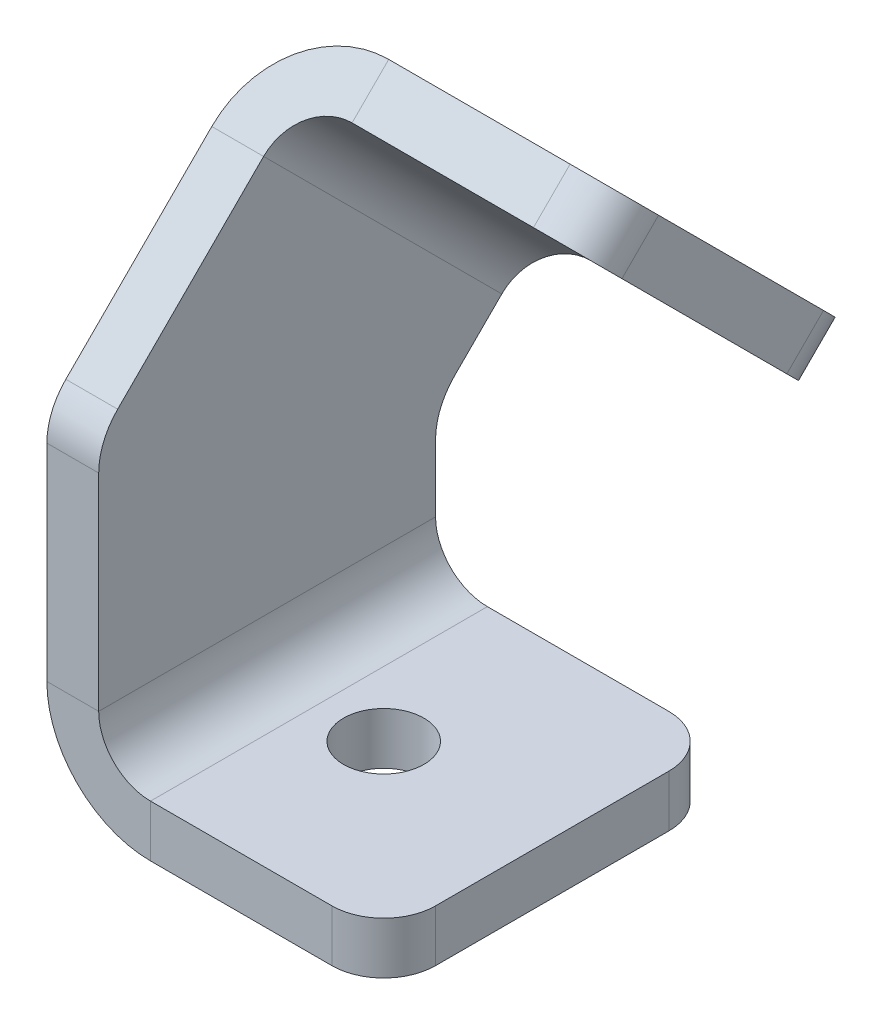
ISO-10303-21;
HEADER;
FILE_DESCRIPTION(('STEP AP214'),'2;1');
FILE_NAME('part.step','',(''),(''),'','','');
FILE_SCHEMA(('AUTOMOTIVE_DESIGN { 1 0 10303 214 1 1 1 1 }'));
ENDSEC;
DATA;
#1=APPLICATION_CONTEXT('core data for automotive mechanical design processes');
#2=APPLICATION_PROTOCOL_DEFINITION('international standard','automotive_design',2000,#1);
#3=PRODUCT_CONTEXT('',#1,'mechanical');
#4=PRODUCT('Part','Part','',(#3));
#5=PRODUCT_RELATED_PRODUCT_CATEGORY('part','',(#4));
#6=PRODUCT_DEFINITION_FORMATION('','',#4);
#7=PRODUCT_DEFINITION_CONTEXT('part definition',#1,'design');
#8=PRODUCT_DEFINITION('design','',#6,#7);
#9=PRODUCT_DEFINITION_SHAPE('','',#8);
#10=(LENGTH_UNIT() NAMED_UNIT(*) SI_UNIT(.MILLI.,.METRE.));
#11=(NAMED_UNIT(*) PLANE_ANGLE_UNIT() SI_UNIT($,.RADIAN.));
#12=(NAMED_UNIT(*) SI_UNIT($,.STERADIAN.) SOLID_ANGLE_UNIT());
#13=UNCERTAINTY_MEASURE_WITH_UNIT(LENGTH_MEASURE(1.E-05),#10,'distance_accuracy_value','');
#14=(GEOMETRIC_REPRESENTATION_CONTEXT(3) GLOBAL_UNCERTAINTY_ASSIGNED_CONTEXT((#13)) GLOBAL_UNIT_ASSIGNED_CONTEXT((#10,
#11,#12)) REPRESENTATION_CONTEXT('',''));
#15=CARTESIAN_POINT('',(0.,0.,0.));
#16=DIRECTION('',(0.,0.,1.));
#17=DIRECTION('',(1.,0.,0.));
#18=AXIS2_PLACEMENT_3D('',#15,#16,#17);
#19=CARTESIAN_POINT('',(-9.79412775812671,3.31915890761504,12.5965463921812));
#20=DIRECTION('',(1.,0.,0.));
#21=DIRECTION('',(0.,0.,-1.));
#22=AXIS2_PLACEMENT_3D('',#19,#20,#21);
#23=CYLINDRICAL_SURFACE('',#22,5.);
#24=DIRECTION('',(1.,0.,0.));
#25=VECTOR('',#24,1.);
#26=CARTESIAN_POINT('',(-9.79412775812671,6.85469281354778,16.132080298114));
#27=LINE('',#26,#25);
#28=CARTESIAN_POINT('',(-13.7941277581267,6.85469281354778,16.132080298114));
#29=VERTEX_POINT('',#28);
#30=CARTESIAN_POINT('',(-9.79412775812671,6.85469281354778,16.132080298114));
#31=VERTEX_POINT('',#30);
#32=EDGE_CURVE('E10',#29,#31,#27,.T.);
#33=ORIENTED_EDGE('',*,*,#32,.F.);
#34=CARTESIAN_POINT('',(-13.7941277581267,3.31915890761504,12.5965463921812));
#35=DIRECTION('',(1.,0.,0.));
#36=DIRECTION('',(0.,0.,-1.));
#37=AXIS2_PLACEMENT_3D('',#34,#35,#36);
#38=CIRCLE('',#37,5.);
#39=CARTESIAN_POINT('',(-13.7941277581267,3.31915890761504,17.5965463921812));
#40=VERTEX_POINT('',#39);
#41=EDGE_CURVE('E136',#29,#40,#38,.T.);
#42=ORIENTED_EDGE('',*,*,#41,.T.);
#43=DIRECTION('',(1.,0.,0.));
#44=VECTOR('',#43,1.);
#45=CARTESIAN_POINT('',(-9.79412775812671,3.31915890761504,17.5965463921812));
#46=LINE('',#45,#44);
#47=CARTESIAN_POINT('',(-9.79412775812671,3.31915890761504,17.5965463921812));
#48=VERTEX_POINT('',#47);
#49=EDGE_CURVE('E26',#40,#48,#46,.T.);
#50=ORIENTED_EDGE('',*,*,#49,.T.);
#51=CARTESIAN_POINT('',(-9.79412775812671,3.31915890761504,12.5965463921812));
#52=DIRECTION('',(1.,0.,0.));
#53=DIRECTION('',(0.,0.,-1.));
#54=AXIS2_PLACEMENT_3D('',#51,#52,#53);
#55=CIRCLE('',#54,5.);
#56=EDGE_CURVE('E254',#31,#48,#55,.T.);
#57=ORIENTED_EDGE('',*,*,#56,.F.);
#58=EDGE_LOOP('',(#33,#42,#50,#57));
#59=FACE_BOUND('',#58,.T.);
#60=ADVANCED_FACE('F16',(#59),#23,.T.);
#61=CARTESIAN_POINT('',(-9.79412775812671,-20.6097732805195,17.5965463921812));
#62=DIRECTION('',(0.,0.,-1.));
#63=DIRECTION('',(0.,1.,0.));
#64=AXIS2_PLACEMENT_3D('',#61,#62,#63);
#65=PLANE('',#64);
#66=ORIENTED_EDGE('',*,*,#49,.F.);
#67=DIRECTION('',(0.,1.,0.));
#68=VECTOR('',#67,1.);
#69=CARTESIAN_POINT('',(-13.7941277581267,-20.6097732805195,17.5965463921812));
#70=LINE('',#69,#68);
#71=CARTESIAN_POINT('',(-13.7941277581267,-12.6097732805195,17.5965463921812));
#72=VERTEX_POINT('',#71);
#73=EDGE_CURVE('E195',#40,#72,#70,.F.);
#74=ORIENTED_EDGE('',*,*,#73,.T.);
#75=DIRECTION('',(1.,0.,0.));
#76=VECTOR('',#75,1.);
#77=CARTESIAN_POINT('',(-9.79412775812671,-12.6097732805195,17.5965463921812));
#78=LINE('',#77,#76);
#79=CARTESIAN_POINT('',(-9.79412775812671,-12.6097732805195,17.5965463921812));
#80=VERTEX_POINT('',#79);
#81=EDGE_CURVE('E247',#72,#80,#78,.T.);
#82=ORIENTED_EDGE('',*,*,#81,.T.);
#83=DIRECTION('',(0.,1.,0.));
#84=VECTOR('',#83,1.);
#85=CARTESIAN_POINT('',(-9.79412775812671,-20.6097732805195,17.5965463921812));
#86=LINE('',#85,#84);
#87=EDGE_CURVE('E264',#48,#80,#86,.F.);
#88=ORIENTED_EDGE('',*,*,#87,.F.);
#89=EDGE_LOOP('',(#66,#74,#82,#88));
#90=FACE_BOUND('',#89,.T.);
#91=ADVANCED_FACE('F267',(#90),#65,.F.);
#92=CARTESIAN_POINT('',(-5.7941277581267,-12.6097732805195,17.5965463921812));
#93=DIRECTION('',(0.,0.,1.));
#94=DIRECTION('',(1.,0.,0.));
#95=AXIS2_PLACEMENT_3D('',#92,#93,#94);
#96=PLANE('',#95);
#97=ORIENTED_EDGE('',*,*,#81,.F.);
#98=CARTESIAN_POINT('',(-5.7941277581267,-12.6097732805195,17.5965463921812));
#99=DIRECTION('',(0.,0.,1.));
#100=DIRECTION('',(1.,0.,0.));
#101=AXIS2_PLACEMENT_3D('',#98,#99,#100);
#102=CIRCLE('',#101,8.);
#103=CARTESIAN_POINT('',(-5.79412775812671,-20.6097732805195,17.5965463921812));
#104=VERTEX_POINT('',#103);
#105=EDGE_CURVE('E170',#104,#72,#102,.F.);
#106=ORIENTED_EDGE('',*,*,#105,.F.);
#107=DIRECTION('',(0.,1.,0.));
#108=VECTOR('',#107,1.);
#109=CARTESIAN_POINT('',(-5.7941277581267,-16.6097732805195,17.5965463921812));
#110=LINE('',#109,#108);
#111=CARTESIAN_POINT('',(-5.7941277581267,-16.6097732805195,17.5965463921812));
#112=VERTEX_POINT('',#111);
#113=EDGE_CURVE('E244',#104,#112,#110,.T.);
#114=ORIENTED_EDGE('',*,*,#113,.T.);
#115=CARTESIAN_POINT('',(-5.7941277581267,-12.6097732805195,17.5965463921812));
#116=DIRECTION('',(0.,0.,-1.));
#117=DIRECTION('',(-1.,0.,0.));
#118=AXIS2_PLACEMENT_3D('',#115,#116,#117);
#119=CIRCLE('',#118,4.);
#120=EDGE_CURVE('E279',#112,#80,#119,.T.);
#121=ORIENTED_EDGE('',*,*,#120,.T.);
#122=EDGE_LOOP('',(#97,#106,#114,#121));
#123=FACE_BOUND('',#122,.T.);
#124=ADVANCED_FACE('F336',(#123),#96,.T.);
#125=CARTESIAN_POINT('',(-13.7941277581267,-16.6097732805195,17.5965463921812));
#126=DIRECTION('',(0.,0.,1.));
#127=DIRECTION('',(1.,0.,0.));
#128=AXIS2_PLACEMENT_3D('',#125,#126,#127);
#129=PLANE('',#128);
#130=ORIENTED_EDGE('',*,*,#113,.F.);
#131=DIRECTION('',(1.,0.,0.));
#132=VECTOR('',#131,1.);
#133=CARTESIAN_POINT('',(-13.7941277581267,-20.6097732805195,17.5965463921812));
#134=LINE('',#133,#132);
#135=CARTESIAN_POINT('',(8.20587224187329,-20.6097732805195,17.5965463921812));
#136=VERTEX_POINT('',#135);
#137=EDGE_CURVE('E190',#104,#136,#134,.T.);
#138=ORIENTED_EDGE('',*,*,#137,.T.);
#139=DIRECTION('',(0.,1.,0.));
#140=VECTOR('',#139,1.);
#141=CARTESIAN_POINT('',(8.20587224187329,-16.6097732805195,17.5965463921812));
#142=LINE('',#141,#140);
#143=CARTESIAN_POINT('',(8.20587224187329,-16.6097732805195,17.5965463921812));
#144=VERTEX_POINT('',#143);
#145=EDGE_CURVE('E241',#136,#144,#142,.T.);
#146=ORIENTED_EDGE('',*,*,#145,.T.);
#147=DIRECTION('',(1.,0.,0.));
#148=VECTOR('',#147,1.);
#149=CARTESIAN_POINT('',(-13.7941277581267,-16.6097732805195,17.5965463921812));
#150=LINE('',#149,#148);
#151=EDGE_CURVE('E388',#112,#144,#150,.T.);
#152=ORIENTED_EDGE('',*,*,#151,.F.);
#153=EDGE_LOOP('',(#130,#138,#146,#152));
#154=FACE_BOUND('',#153,.T.);
#155=ADVANCED_FACE('F652',(#154),#129,.T.);
#156=CARTESIAN_POINT('',(8.20587224187329,-16.6097732805195,13.5965463921812));
#157=DIRECTION('',(0.,1.,0.));
#158=DIRECTION('',(0.,0.,1.));
#159=AXIS2_PLACEMENT_3D('',#156,#157,#158);
#160=CYLINDRICAL_SURFACE('',#159,4.);
#161=ORIENTED_EDGE('',*,*,#145,.F.);
#162=CARTESIAN_POINT('',(8.20587224187329,-20.6097732805195,13.5965463921812));
#163=DIRECTION('',(0.,1.,0.));
#164=DIRECTION('',(0.,0.,1.));
#165=AXIS2_PLACEMENT_3D('',#162,#163,#164);
#166=CIRCLE('',#165,4.);
#167=CARTESIAN_POINT('',(12.2058722418733,-20.6097732805195,13.5965463921812));
#168=VERTEX_POINT('',#167);
#169=EDGE_CURVE('E166',#136,#168,#166,.T.);
#170=ORIENTED_EDGE('',*,*,#169,.T.);
#171=DIRECTION('',(0.,1.,0.));
#172=VECTOR('',#171,1.);
#173=CARTESIAN_POINT('',(12.2058722418733,-16.6097732805195,13.5965463921812));
#174=LINE('',#173,#172);
#175=CARTESIAN_POINT('',(12.2058722418733,-16.6097732805195,13.5965463921812));
#176=VERTEX_POINT('',#175);
#177=EDGE_CURVE('E238',#168,#176,#174,.T.);
#178=ORIENTED_EDGE('',*,*,#177,.T.);
#179=CARTESIAN_POINT('',(8.20587224187329,-16.6097732805195,13.5965463921812));
#180=DIRECTION('',(0.,1.,0.));
#181=DIRECTION('',(0.,0.,1.));
#182=AXIS2_PLACEMENT_3D('',#179,#180,#181);
#183=CIRCLE('',#182,4.);
#184=EDGE_CURVE('E384',#144,#176,#183,.T.);
#185=ORIENTED_EDGE('',*,*,#184,.F.);
#186=EDGE_LOOP('',(#161,#170,#178,#185));
#187=FACE_BOUND('',#186,.T.);
#188=ADVANCED_FACE('F643',(#187),#160,.T.);
#189=CARTESIAN_POINT('',(12.2058722418733,-16.6097732805195,17.5965463921812));
#190=DIRECTION('',(1.,0.,0.));
#191=DIRECTION('',(0.,0.,-1.));
#192=AXIS2_PLACEMENT_3D('',#189,#190,#191);
#193=PLANE('',#192);
#194=ORIENTED_EDGE('',*,*,#177,.F.);
#195=DIRECTION('',(0.,0.,1.));
#196=VECTOR('',#195,1.);
#197=CARTESIAN_POINT('',(12.2058722418733,-20.6097732805195,17.5965463921812));
#198=LINE('',#197,#196);
#199=CARTESIAN_POINT('',(12.2058722418733,-20.6097732805195,-4.40345360781876));
#200=VERTEX_POINT('',#199);
#201=EDGE_CURVE('E184',#168,#200,#198,.F.);
#202=ORIENTED_EDGE('',*,*,#201,.T.);
#203=DIRECTION('',(0.,1.,0.));
#204=VECTOR('',#203,1.);
#205=CARTESIAN_POINT('',(12.2058722418733,-16.6097732805195,-4.40345360781876));
#206=LINE('',#205,#204);
#207=CARTESIAN_POINT('',(12.2058722418733,-16.6097732805195,-4.40345360781876));
#208=VERTEX_POINT('',#207);
#209=EDGE_CURVE('E235',#200,#208,#206,.T.);
#210=ORIENTED_EDGE('',*,*,#209,.T.);
#211=DIRECTION('',(0.,0.,-1.));
#212=VECTOR('',#211,1.);
#213=CARTESIAN_POINT('',(12.2058722418733,-16.6097732805195,17.5965463921812));
#214=LINE('',#213,#212);
#215=EDGE_CURVE('E401',#176,#208,#214,.T.);
#216=ORIENTED_EDGE('',*,*,#215,.F.);
#217=EDGE_LOOP('',(#194,#202,#210,#216));
#218=FACE_BOUND('',#217,.T.);
#219=ADVANCED_FACE('F634',(#218),#193,.T.);
#220=CARTESIAN_POINT('',(8.20587224187329,-16.6097732805195,-4.40345360781877));
#221=DIRECTION('',(0.,1.,0.));
#222=DIRECTION('',(0.,0.,1.));
#223=AXIS2_PLACEMENT_3D('',#220,#221,#222);
#224=CYLINDRICAL_SURFACE('',#223,4.);
#225=ORIENTED_EDGE('',*,*,#209,.F.);
#226=CARTESIAN_POINT('',(8.20587224187329,-20.6097732805195,-4.40345360781877));
#227=DIRECTION('',(0.,1.,0.));
#228=DIRECTION('',(0.,0.,1.));
#229=AXIS2_PLACEMENT_3D('',#226,#227,#228);
#230=CIRCLE('',#229,4.);
#231=CARTESIAN_POINT('',(8.20587224187329,-20.6097732805195,-8.40345360781876));
#232=VERTEX_POINT('',#231);
#233=EDGE_CURVE('E181',#200,#232,#230,.T.);
#234=ORIENTED_EDGE('',*,*,#233,.T.);
#235=DIRECTION('',(0.,1.,0.));
#236=VECTOR('',#235,1.);
#237=CARTESIAN_POINT('',(8.20587224187329,-16.6097732805195,-8.40345360781876));
#238=LINE('',#237,#236);
#239=CARTESIAN_POINT('',(8.20587224187329,-16.6097732805195,-8.40345360781876));
#240=VERTEX_POINT('',#239);
#241=EDGE_CURVE('E232',#232,#240,#238,.T.);
#242=ORIENTED_EDGE('',*,*,#241,.T.);
#243=CARTESIAN_POINT('',(8.20587224187329,-16.6097732805195,-4.40345360781877));
#244=DIRECTION('',(0.,1.,0.));
#245=DIRECTION('',(0.,0.,1.));
#246=AXIS2_PLACEMENT_3D('',#243,#244,#245);
#247=CIRCLE('',#246,4.);
#248=EDGE_CURVE('E398',#208,#240,#247,.T.);
#249=ORIENTED_EDGE('',*,*,#248,.F.);
#250=EDGE_LOOP('',(#225,#234,#242,#249));
#251=FACE_BOUND('',#250,.T.);
#252=ADVANCED_FACE('F626',(#251),#224,.T.);
#253=CARTESIAN_POINT('',(-13.7941277581267,-16.6097732805195,-8.40345360781876));
#254=DIRECTION('',(0.,0.,1.));
#255=DIRECTION('',(1.,0.,0.));
#256=AXIS2_PLACEMENT_3D('',#253,#254,#255);
#257=PLANE('',#256);
#258=ORIENTED_EDGE('',*,*,#241,.F.);
#259=DIRECTION('',(1.,0.,0.));
#260=VECTOR('',#259,1.);
#261=CARTESIAN_POINT('',(-13.7941277581267,-20.6097732805195,-8.40345360781876));
#262=LINE('',#261,#260);
#263=CARTESIAN_POINT('',(-5.79412775812671,-20.6097732805195,-8.40345360781876));
#264=VERTEX_POINT('',#263);
#265=EDGE_CURVE('E178',#264,#232,#262,.T.);
#266=ORIENTED_EDGE('',*,*,#265,.F.);
#267=DIRECTION('',(0.,1.,0.));
#268=VECTOR('',#267,1.);
#269=CARTESIAN_POINT('',(-5.7941277581267,-16.6097732805195,-8.40345360781876));
#270=LINE('',#269,#268);
#271=CARTESIAN_POINT('',(-5.7941277581267,-16.6097732805195,-8.40345360781876));
#272=VERTEX_POINT('',#271);
#273=EDGE_CURVE('E229',#264,#272,#270,.T.);
#274=ORIENTED_EDGE('',*,*,#273,.T.);
#275=DIRECTION('',(1.,0.,0.));
#276=VECTOR('',#275,1.);
#277=CARTESIAN_POINT('',(-13.7941277581267,-16.6097732805195,-8.40345360781876));
#278=LINE('',#277,#276);
#279=EDGE_CURVE('E396',#272,#240,#278,.T.);
#280=ORIENTED_EDGE('',*,*,#279,.T.);
#281=EDGE_LOOP('',(#258,#266,#274,#280));
#282=FACE_BOUND('',#281,.T.);
#283=ADVANCED_FACE('F618',(#282),#257,.F.);
#284=CARTESIAN_POINT('',(-5.7941277581267,-12.6097732805195,-8.40345360781876));
#285=DIRECTION('',(0.,0.,1.));
#286=DIRECTION('',(1.,0.,0.));
#287=AXIS2_PLACEMENT_3D('',#284,#285,#286);
#288=PLANE('',#287);
#289=ORIENTED_EDGE('',*,*,#273,.F.);
#290=CARTESIAN_POINT('',(-5.7941277581267,-12.6097732805195,-8.40345360781876));
#291=DIRECTION('',(0.,0.,1.));
#292=DIRECTION('',(1.,0.,0.));
#293=AXIS2_PLACEMENT_3D('',#290,#291,#292);
#294=CIRCLE('',#293,8.);
#295=CARTESIAN_POINT('',(-13.7941277581267,-12.6097732805195,-8.40345360781876));
#296=VERTEX_POINT('',#295);
#297=EDGE_CURVE('E175',#296,#264,#294,.T.);
#298=ORIENTED_EDGE('',*,*,#297,.F.);
#299=DIRECTION('',(1.,0.,0.));
#300=VECTOR('',#299,1.);
#301=CARTESIAN_POINT('',(-9.79412775812671,-12.6097732805195,-8.40345360781876));
#302=LINE('',#301,#300);
#303=CARTESIAN_POINT('',(-9.79412775812671,-12.6097732805195,-8.40345360781876));
#304=VERTEX_POINT('',#303);
#305=EDGE_CURVE('E226',#296,#304,#302,.T.);
#306=ORIENTED_EDGE('',*,*,#305,.T.);
#307=CARTESIAN_POINT('',(-5.7941277581267,-12.6097732805195,-8.40345360781876));
#308=DIRECTION('',(0.,0.,-1.));
#309=DIRECTION('',(-1.,0.,0.));
#310=AXIS2_PLACEMENT_3D('',#307,#308,#309);
#311=CIRCLE('',#310,4.);
#312=EDGE_CURVE('E281',#304,#272,#311,.F.);
#313=ORIENTED_EDGE('',*,*,#312,.T.);
#314=EDGE_LOOP('',(#289,#298,#306,#313));
#315=FACE_BOUND('',#314,.T.);
#316=ADVANCED_FACE('F319',(#315),#288,.F.);
#317=CARTESIAN_POINT('',(-9.79412775812671,-20.6097732805195,-8.40345360781876));
#318=DIRECTION('',(0.,0.,-1.));
#319=DIRECTION('',(0.,1.,0.));
#320=AXIS2_PLACEMENT_3D('',#317,#318,#319);
#321=PLANE('',#320);
#322=ORIENTED_EDGE('',*,*,#305,.F.);
#323=DIRECTION('',(0.,1.,0.));
#324=VECTOR('',#323,1.);
#325=CARTESIAN_POINT('',(-13.7941277581267,-20.6097732805195,-8.40345360781876));
#326=LINE('',#325,#324);
#327=CARTESIAN_POINT('',(-13.7941277581267,-7.45039371408545,-8.40345360781876));
#328=VERTEX_POINT('',#327);
#329=EDGE_CURVE('E171',#328,#296,#326,.F.);
#330=ORIENTED_EDGE('',*,*,#329,.F.);
#331=DIRECTION('',(1.,0.,0.));
#332=VECTOR('',#331,1.);
#333=CARTESIAN_POINT('',(-9.79412775812671,-7.45039371408545,-8.40345360781876));
#334=LINE('',#333,#332);
#335=CARTESIAN_POINT('',(-9.79412775812671,-7.45039371408545,-8.40345360781876));
#336=VERTEX_POINT('',#335);
#337=EDGE_CURVE('E223',#328,#336,#334,.T.);
#338=ORIENTED_EDGE('',*,*,#337,.T.);
#339=DIRECTION('',(0.,1.,0.));
#340=VECTOR('',#339,1.);
#341=CARTESIAN_POINT('',(-9.79412775812671,-20.6097732805195,-8.40345360781876));
#342=LINE('',#341,#340);
#343=EDGE_CURVE('E270',#336,#304,#342,.F.);
#344=ORIENTED_EDGE('',*,*,#343,.T.);
#345=EDGE_LOOP('',(#322,#330,#338,#344));
#346=FACE_BOUND('',#345,.T.);
#347=ADVANCED_FACE('F602',(#346),#321,.T.);
#348=CARTESIAN_POINT('',(-9.79412775812671,-7.45039371408545,-13.4034536078188));
#349=DIRECTION('',(1.,0.,0.));
#350=DIRECTION('',(0.,0.,-1.));
#351=AXIS2_PLACEMENT_3D('',#348,#349,#350);
#352=CYLINDRICAL_SURFACE('',#351,5.);
#353=ORIENTED_EDGE('',*,*,#337,.F.);
#354=CARTESIAN_POINT('',(-13.7941277581267,-7.45039371408545,-13.4034536078188));
#355=DIRECTION('',(1.,0.,0.));
#356=DIRECTION('',(0.,0.,-1.));
#357=AXIS2_PLACEMENT_3D('',#354,#355,#356);
#358=CIRCLE('',#357,5.);
#359=CARTESIAN_POINT('',(-13.7941277581267,-3.91485980815271,-9.86791970188603));
#360=VERTEX_POINT('',#359);
#361=EDGE_CURVE('E167',#328,#360,#358,.F.);
#362=ORIENTED_EDGE('',*,*,#361,.T.);
#363=DIRECTION('',(1.,0.,0.));
#364=VECTOR('',#363,1.);
#365=CARTESIAN_POINT('',(-9.79412775812671,-3.91485980815271,-9.86791970188603));
#366=LINE('',#365,#364);
#367=CARTESIAN_POINT('',(-9.79412775812671,-3.91485980815271,-9.86791970188603));
#368=VERTEX_POINT('',#367);
#369=EDGE_CURVE('E220',#360,#368,#366,.T.);
#370=ORIENTED_EDGE('',*,*,#369,.T.);
#371=CARTESIAN_POINT('',(-9.79412775812671,-7.45039371408545,-13.4034536078188));
#372=DIRECTION('',(1.,0.,0.));
#373=DIRECTION('',(0.,0.,-1.));
#374=AXIS2_PLACEMENT_3D('',#371,#372,#373);
#375=CIRCLE('',#374,5.);
#376=EDGE_CURVE('E276',#336,#368,#375,.F.);
#377=ORIENTED_EDGE('',*,*,#376,.F.);
#378=EDGE_LOOP('',(#353,#362,#370,#377));
#379=FACE_BOUND('',#378,.T.);
#380=ADVANCED_FACE('F594',(#379),#352,.F.);
#381=CARTESIAN_POINT('',(-9.79412775812671,5.39022671948047,-19.1730062295192));
#382=DIRECTION('',(0.,0.707106781186549,0.707106781186546));
#383=DIRECTION('',(0.,-0.707106781186546,0.707106781186549));
#384=AXIS2_PLACEMENT_3D('',#381,#382,#383);
#385=PLANE('',#384);
#386=ORIENTED_EDGE('',*,*,#369,.F.);
#387=DIRECTION('',(0.,-0.707106781186546,0.707106781186549));
#388=VECTOR('',#387,1.);
#389=CARTESIAN_POINT('',(-13.7941277581267,5.39022671948047,-19.1730062295192));
#390=LINE('',#389,#388);
#391=CARTESIAN_POINT('',(-13.7941277581267,-0.266627530011918,-13.5161519800268));
#392=VERTEX_POINT('',#391);
#393=EDGE_CURVE('E132',#360,#392,#390,.F.);
#394=ORIENTED_EDGE('',*,*,#393,.T.);
#395=DIRECTION('',(1.,0.,0.));
#396=VECTOR('',#395,1.);
#397=CARTESIAN_POINT('',(-9.79412775812671,-0.266627530011911,-13.5161519800268));
#398=LINE('',#397,#396);
#399=CARTESIAN_POINT('',(-9.79412775812671,-0.266627530011911,-13.5161519800268));
#400=VERTEX_POINT('',#399);
#401=EDGE_CURVE('E217',#392,#400,#398,.T.);
#402=ORIENTED_EDGE('',*,*,#401,.T.);
#403=DIRECTION('',(0.,-0.707106781186546,0.707106781186549));
#404=VECTOR('',#403,1.);
#405=CARTESIAN_POINT('',(-9.79412775812671,5.39022671948047,-19.1730062295192));
#406=LINE('',#405,#404);
#407=EDGE_CURVE('E380',#368,#400,#406,.F.);
#408=ORIENTED_EDGE('',*,*,#407,.F.);
#409=EDGE_LOOP('',(#386,#394,#402,#408));
#410=FACE_BOUND('',#409,.T.);
#411=ADVANCED_FACE('F379',(#410),#385,.F.);
#412=CARTESIAN_POINT('',(-5.7941277581267,-0.266627530011915,-13.5161519800268));
#413=DIRECTION('',(0.,0.707106781186549,0.707106781186546));
#414=DIRECTION('',(0.,-0.707106781186546,0.707106781186549));
#415=AXIS2_PLACEMENT_3D('',#412,#413,#414);
#416=PLANE('',#415);
#417=ORIENTED_EDGE('',*,*,#401,.F.);
#418=CARTESIAN_POINT('',(-5.7941277581267,-0.266627530011915,-13.5161519800268));
#419=DIRECTION('',(0.,0.707106781186549,0.707106781186546));
#420=DIRECTION('',(0.,-0.707106781186546,0.707106781186549));
#421=AXIS2_PLACEMENT_3D('',#418,#419,#420);
#422=CIRCLE('',#421,8.);
#423=CARTESIAN_POINT('',(-5.7941277581267,5.39022671948046,-19.1730062295192));
#424=VERTEX_POINT('',#423);
#425=EDGE_CURVE('E128',#424,#392,#422,.T.);
#426=ORIENTED_EDGE('',*,*,#425,.F.);
#427=DIRECTION('',(0.,-0.707106781186546,0.707106781186549));
#428=VECTOR('',#427,1.);
#429=CARTESIAN_POINT('',(-5.7941277581267,2.56179959473428,-16.344579104773));
#430=LINE('',#429,#428);
#431=CARTESIAN_POINT('',(-5.7941277581267,2.56179959473428,-16.344579104773));
#432=VERTEX_POINT('',#431);
#433=EDGE_CURVE('E34',#424,#432,#430,.T.);
#434=ORIENTED_EDGE('',*,*,#433,.T.);
#435=CARTESIAN_POINT('',(-5.7941277581267,-0.266627530011915,-13.5161519800268));
#436=DIRECTION('',(0.,-0.707106781186549,-0.707106781186546));
#437=DIRECTION('',(0.,0.707106781186546,-0.707106781186549));
#438=AXIS2_PLACEMENT_3D('',#435,#436,#437);
#439=CIRCLE('',#438,4.);
#440=EDGE_CURVE('E118',#432,#400,#439,.F.);
#441=ORIENTED_EDGE('',*,*,#440,.T.);
#442=EDGE_LOOP('',(#417,#426,#434,#441));
#443=FACE_BOUND('',#442,.T.);
#444=ADVANCED_FACE('F373',(#443),#416,.F.);
#445=CARTESIAN_POINT('',(-13.7941277581267,2.56179959473428,-16.344579104773));
#446=DIRECTION('',(0.,-0.707106781186549,-0.707106781186546));
#447=DIRECTION('',(1.,0.,0.));
#448=AXIS2_PLACEMENT_3D('',#445,#446,#447);
#449=PLANE('',#448);
#450=ORIENTED_EDGE('',*,*,#433,.F.);
#451=DIRECTION('',(-1.,0.,0.));
#452=VECTOR('',#451,1.);
#453=CARTESIAN_POINT('',(-13.7941277581267,5.39022671948046,-19.1730062295192));
#454=LINE('',#453,#452);
#455=CARTESIAN_POINT('',(8.20587224187329,5.39022671948046,-19.1730062295192));
#456=VERTEX_POINT('',#455);
#457=EDGE_CURVE('E161',#424,#456,#454,.F.);
#458=ORIENTED_EDGE('',*,*,#457,.T.);
#459=DIRECTION('',(0.,-0.707106781186546,0.707106781186549));
#460=VECTOR('',#459,1.);
#461=CARTESIAN_POINT('',(8.20587224187329,2.56179959473428,-16.344579104773));
#462=LINE('',#461,#460);
#463=CARTESIAN_POINT('',(8.20587224187329,2.56179959473428,-16.344579104773));
#464=VERTEX_POINT('',#463);
#465=EDGE_CURVE('E213',#456,#464,#462,.T.);
#466=ORIENTED_EDGE('',*,*,#465,.T.);
#467=DIRECTION('',(1.,0.,0.));
#468=VECTOR('',#467,1.);
#469=CARTESIAN_POINT('',(-13.7941277581267,2.56179959473428,-16.344579104773));
#470=LINE('',#469,#468);
#471=EDGE_CURVE('E287',#432,#464,#470,.T.);
#472=ORIENTED_EDGE('',*,*,#471,.F.);
#473=EDGE_LOOP('',(#450,#458,#466,#472));
#474=FACE_BOUND('',#473,.T.);
#475=ADVANCED_FACE('F571',(#474),#449,.T.);
#476=CARTESIAN_POINT('',(8.20587224187329,5.39022671948047,-13.5161519800268));
#477=DIRECTION('',(0.,-0.707106781186546,0.707106781186549));
#478=DIRECTION('',(0.,-0.707106781186549,-0.707106781186546));
#479=AXIS2_PLACEMENT_3D('',#476,#477,#478);
#480=CYLINDRICAL_SURFACE('',#479,4.);
#481=ORIENTED_EDGE('',*,*,#465,.F.);
#482=CARTESIAN_POINT('',(8.20587224187329,8.21865384422666,-16.344579104773));
#483=DIRECTION('',(0.,-0.707106781186546,0.707106781186549));
#484=DIRECTION('',(0.,-0.707106781186549,-0.707106781186546));
#485=AXIS2_PLACEMENT_3D('',#482,#483,#484);
#486=CIRCLE('',#485,4.);
#487=CARTESIAN_POINT('',(12.2058722418733,8.21865384422666,-16.3445791047731));
#488=VERTEX_POINT('',#487);
#489=EDGE_CURVE('E158',#456,#488,#486,.T.);
#490=ORIENTED_EDGE('',*,*,#489,.T.);
#491=DIRECTION('',(0.,-0.707106781186546,0.707106781186549));
#492=VECTOR('',#491,1.);
#493=CARTESIAN_POINT('',(12.2058722418733,5.39022671948048,-13.5161519800268));
#494=LINE('',#493,#492);
#495=CARTESIAN_POINT('',(12.2058722418733,5.39022671948048,-13.5161519800268));
#496=VERTEX_POINT('',#495);
#497=EDGE_CURVE('E210',#488,#496,#494,.T.);
#498=ORIENTED_EDGE('',*,*,#497,.T.);
#499=CARTESIAN_POINT('',(8.20587224187329,5.39022671948047,-13.5161519800268));
#500=DIRECTION('',(0.,-0.707106781186546,0.707106781186549));
#501=DIRECTION('',(0.,-0.707106781186549,-0.707106781186546));
#502=AXIS2_PLACEMENT_3D('',#499,#500,#501);
#503=CIRCLE('',#502,4.);
#504=EDGE_CURVE('E290',#464,#496,#503,.T.);
#505=ORIENTED_EDGE('',*,*,#504,.F.);
#506=EDGE_LOOP('',(#481,#490,#498,#505));
#507=FACE_BOUND('',#506,.T.);
#508=ADVANCED_FACE('F562',(#507),#480,.T.);
#509=CARTESIAN_POINT('',(12.2058722418733,20.9465759055845,2.04019720607717));
#510=DIRECTION('',(-1.,0.,0.));
#511=DIRECTION('',(0.,-0.707106781186549,-0.707106781186546));
#512=AXIS2_PLACEMENT_3D('',#509,#510,#511);
#513=PLANE('',#512);
#514=ORIENTED_EDGE('',*,*,#497,.F.);
#515=DIRECTION('',(0.,0.707106781186549,0.707106781186546));
#516=VECTOR('',#515,1.);
#517=CARTESIAN_POINT('',(12.2058722418733,23.7750030303307,-0.788229918669026));
#518=LINE('',#517,#516);
#519=CARTESIAN_POINT('',(12.2058722418733,20.9465759055845,-3.61665704341521));
#520=VERTEX_POINT('',#519);
#521=EDGE_CURVE('E155',#520,#488,#518,.F.);
#522=ORIENTED_EDGE('',*,*,#521,.F.);
#523=DIRECTION('',(0.,-0.707106781186546,0.707106781186549));
#524=VECTOR('',#523,1.);
#525=CARTESIAN_POINT('',(12.2058722418733,18.1181487808384,-0.788229918669015));
#526=LINE('',#525,#524);
#527=CARTESIAN_POINT('',(12.2058722418733,18.1181487808384,-0.788229918669015));
#528=VERTEX_POINT('',#527);
#529=EDGE_CURVE('E207',#520,#528,#526,.T.);
#530=ORIENTED_EDGE('',*,*,#529,.T.);
#531=DIRECTION('',(0.,-0.707106781186549,-0.707106781186546));
#532=VECTOR('',#531,1.);
#533=CARTESIAN_POINT('',(12.2058722418733,20.9465759055845,2.04019720607717));
#534=LINE('',#533,#532);
#535=EDGE_CURVE('E293',#528,#496,#534,.T.);
#536=ORIENTED_EDGE('',*,*,#535,.T.);
#537=EDGE_LOOP('',(#514,#522,#530,#536));
#538=FACE_BOUND('',#537,.T.);
#539=ADVANCED_FACE('F554',(#538),#513,.F.);
#540=CARTESIAN_POINT('',(8.20587224187329,18.1181487808384,-0.788229918669015));
#541=DIRECTION('',(0.,-0.707106781186546,0.707106781186549));
#542=DIRECTION('',(0.,-0.707106781186549,-0.707106781186546));
#543=AXIS2_PLACEMENT_3D('',#540,#541,#542);
#544=CYLINDRICAL_SURFACE('',#543,4.);
#545=ORIENTED_EDGE('',*,*,#529,.F.);
#546=CARTESIAN_POINT('',(8.20587224187329,20.9465759055845,-3.61665704341521));
#547=DIRECTION('',(0.,-0.707106781186546,0.707106781186549));
#548=DIRECTION('',(0.,-0.707106781186549,-0.707106781186546));
#549=AXIS2_PLACEMENT_3D('',#546,#547,#548);
#550=CIRCLE('',#549,4.);
#551=CARTESIAN_POINT('',(8.20587224187329,23.7750030303307,-0.788229918669026));
#552=VERTEX_POINT('',#551);
#553=EDGE_CURVE('E152',#520,#552,#550,.T.);
#554=ORIENTED_EDGE('',*,*,#553,.T.);
#555=DIRECTION('',(0.,-0.707106781186546,0.707106781186549));
#556=VECTOR('',#555,1.);
#557=CARTESIAN_POINT('',(8.20587224187329,20.9465759055845,2.04019720607717));
#558=LINE('',#557,#556);
#559=CARTESIAN_POINT('',(8.20587224187329,20.9465759055845,2.04019720607717));
#560=VERTEX_POINT('',#559);
#561=EDGE_CURVE('E204',#552,#560,#558,.T.);
#562=ORIENTED_EDGE('',*,*,#561,.T.);
#563=CARTESIAN_POINT('',(8.20587224187329,18.1181487808384,-0.788229918669015));
#564=DIRECTION('',(0.,-0.707106781186546,0.707106781186549));
#565=DIRECTION('',(0.,-0.707106781186549,-0.707106781186546));
#566=AXIS2_PLACEMENT_3D('',#563,#564,#565);
#567=CIRCLE('',#566,4.);
#568=EDGE_CURVE('E296',#528,#560,#567,.T.);
#569=ORIENTED_EDGE('',*,*,#568,.F.);
#570=EDGE_LOOP('',(#545,#554,#562,#569));
#571=FACE_BOUND('',#570,.T.);
#572=ADVANCED_FACE('F359',(#571),#544,.T.);
#573=CARTESIAN_POINT('',(-13.7941277581267,20.9465759055845,2.04019720607717));
#574=DIRECTION('',(0.,-0.707106781186549,-0.707106781186546));
#575=DIRECTION('',(1.,0.,0.));
#576=AXIS2_PLACEMENT_3D('',#573,#574,#575);
#577=PLANE('',#576);
#578=ORIENTED_EDGE('',*,*,#561,.F.);
#579=DIRECTION('',(-1.,0.,0.));
#580=VECTOR('',#579,1.);
#581=CARTESIAN_POINT('',(-13.7941277581267,23.7750030303307,-0.788229918669026));
#582=LINE('',#581,#580);
#583=CARTESIAN_POINT('',(-5.7941277581267,23.7750030303307,-0.788229918669026));
#584=VERTEX_POINT('',#583);
#585=EDGE_CURVE('E144',#584,#552,#582,.F.);
#586=ORIENTED_EDGE('',*,*,#585,.F.);
#587=DIRECTION('',(0.,-0.707106781186546,0.707106781186549));
#588=VECTOR('',#587,1.);
#589=CARTESIAN_POINT('',(-5.7941277581267,20.9465759055845,2.04019720607717));
#590=LINE('',#589,#588);
#591=CARTESIAN_POINT('',(-5.7941277581267,20.9465759055845,2.04019720607717));
#592=VERTEX_POINT('',#591);
#593=EDGE_CURVE('E117',#584,#592,#590,.T.);
#594=ORIENTED_EDGE('',*,*,#593,.T.);
#595=DIRECTION('',(1.,0.,0.));
#596=VECTOR('',#595,1.);
#597=CARTESIAN_POINT('',(-13.7941277581267,20.9465759055845,2.04019720607717));
#598=LINE('',#597,#596);
#599=EDGE_CURVE('E299',#592,#560,#598,.T.);
#600=ORIENTED_EDGE('',*,*,#599,.T.);
#601=EDGE_LOOP('',(#578,#586,#594,#600));
#602=FACE_BOUND('',#601,.T.);
#603=ADVANCED_FACE('F366',(#602),#577,.F.);
#604=CARTESIAN_POINT('',(-5.7941277581267,18.1181487808384,4.86862433082336));
#605=DIRECTION('',(0.,0.707106781186549,0.707106781186546));
#606=DIRECTION('',(0.,-0.707106781186546,0.707106781186549));
#607=AXIS2_PLACEMENT_3D('',#604,#605,#606);
#608=PLANE('',#607);
#609=ORIENTED_EDGE('',*,*,#593,.F.);
#610=CARTESIAN_POINT('',(-5.7941277581267,18.1181487808384,4.86862433082337));
#611=DIRECTION('',(0.,0.707106781186549,0.707106781186546));
#612=DIRECTION('',(0.,-0.707106781186546,0.707106781186549));
#613=AXIS2_PLACEMENT_3D('',#610,#611,#612);
#614=CIRCLE('',#613,8.);
#615=CARTESIAN_POINT('',(-13.7941277581267,18.1181487808383,4.86862433082337));
#616=VERTEX_POINT('',#615);
#617=EDGE_CURVE('E126',#616,#584,#614,.F.);
#618=ORIENTED_EDGE('',*,*,#617,.F.);
#619=DIRECTION('',(1.,0.,0.));
#620=VECTOR('',#619,1.);
#621=CARTESIAN_POINT('',(-9.79412775812671,18.1181487808384,4.86862433082337));
#622=LINE('',#621,#620);
#623=CARTESIAN_POINT('',(-9.79412775812671,18.1181487808384,4.86862433082337));
#624=VERTEX_POINT('',#623);
#625=EDGE_CURVE('E20',#616,#624,#622,.T.);
#626=ORIENTED_EDGE('',*,*,#625,.T.);
#627=CARTESIAN_POINT('',(-5.7941277581267,18.1181487808384,4.86862433082336));
#628=DIRECTION('',(0.,-0.707106781186549,-0.707106781186546));
#629=DIRECTION('',(0.,0.707106781186546,-0.707106781186549));
#630=AXIS2_PLACEMENT_3D('',#627,#628,#629);
#631=CIRCLE('',#630,4.);
#632=EDGE_CURVE('E305',#624,#592,#631,.T.);
#633=ORIENTED_EDGE('',*,*,#632,.T.);
#634=EDGE_LOOP('',(#609,#618,#626,#633));
#635=FACE_BOUND('',#634,.T.);
#636=ADVANCED_FACE('F138',(#635),#608,.T.);
#637=CARTESIAN_POINT('',(-0.794127758126706,-16.6097732805195,4.59654639218123));
#638=DIRECTION('',(0.,1.,0.));
#639=DIRECTION('',(0.,0.,1.));
#640=AXIS2_PLACEMENT_3D('',#637,#638,#639);
#641=CYLINDRICAL_SURFACE('',#640,3.1);
#642=CARTESIAN_POINT('',(-0.794127758126706,-16.6097732805195,4.59654639218123));
#643=DIRECTION('',(0.,1.,0.));
#644=DIRECTION('',(0.,0.,1.));
#645=AXIS2_PLACEMENT_3D('',#642,#643,#644);
#646=CIRCLE('',#645,3.1);
#647=CARTESIAN_POINT('',(-0.794127758126706,-16.6097732805195,7.69654639218123));
#648=VERTEX_POINT('',#647);
#649=EDGE_CURVE('E142',#648,#648,#646,.F.);
#650=ORIENTED_EDGE('',*,*,#649,.F.);
#651=EDGE_LOOP('',(#650));
#652=FACE_BOUND('',#651,.T.);
#653=CARTESIAN_POINT('',(-0.794127758126706,-20.6097732805195,4.59654639218123));
#654=DIRECTION('',(0.,1.,0.));
#655=DIRECTION('',(0.,0.,1.));
#656=AXIS2_PLACEMENT_3D('',#653,#654,#655);
#657=CIRCLE('',#656,3.1);
#658=CARTESIAN_POINT('',(-0.794127758126706,-20.6097732805195,7.69654639218123));
#659=VERTEX_POINT('',#658);
#660=EDGE_CURVE('E187',#659,#659,#657,.F.);
#661=ORIENTED_EDGE('',*,*,#660,.T.);
#662=EDGE_LOOP('',(#661));
#663=FACE_BOUND('',#662,.T.);
#664=ADVANCED_FACE('F18',(#652,#663),#641,.F.);
#665=CARTESIAN_POINT('',(-0.794127758126706,11.7541877501594,-7.15219094934794));
#666=DIRECTION('',(0.,-0.707106781186546,0.707106781186549));
#667=DIRECTION('',(0.,-0.707106781186549,-0.707106781186546));
#668=AXIS2_PLACEMENT_3D('',#665,#666,#667);
#669=CYLINDRICAL_SURFACE('',#668,3.1);
#670=CARTESIAN_POINT('',(-0.794127758126706,11.7541877501594,-7.15219094934794));
#671=DIRECTION('',(0.,0.707106781186546,-0.707106781186549));
#672=DIRECTION('',(0.,0.707106781186549,0.707106781186546));
#673=AXIS2_PLACEMENT_3D('',#670,#671,#672);
#674=CIRCLE('',#673,3.1);
#675=CARTESIAN_POINT('',(-0.794127758126706,13.9462187718377,-4.96015992766964));
#676=VERTEX_POINT('',#675);
#677=EDGE_CURVE('E284',#676,#676,#674,.F.);
#678=ORIENTED_EDGE('',*,*,#677,.T.);
#679=EDGE_LOOP('',(#678));
#680=FACE_BOUND('',#679,.T.);
#681=CARTESIAN_POINT('',(-0.794127758126706,14.5826148749056,-9.98061807409413));
#682=DIRECTION('',(0.,0.707106781186546,-0.707106781186549));
#683=DIRECTION('',(0.,0.707106781186549,0.707106781186546));
#684=AXIS2_PLACEMENT_3D('',#681,#682,#683);
#685=CIRCLE('',#684,3.1);
#686=CARTESIAN_POINT('',(-0.794127758126706,16.7746458965839,-7.78858705241584));
#687=VERTEX_POINT('',#686);
#688=EDGE_CURVE('E163',#687,#687,#685,.F.);
#689=ORIENTED_EDGE('',*,*,#688,.F.);
#690=EDGE_LOOP('',(#689));
#691=FACE_BOUND('',#690,.T.);
#692=ADVANCED_FACE('F412',(#680,#691),#669,.F.);
#693=CARTESIAN_POINT('',(-9.79412775812671,23.7750030303307,-0.788229918669028));
#694=DIRECTION('',(0.,0.707106781186549,0.707106781186546));
#695=DIRECTION('',(0.,-0.707106781186546,0.707106781186549));
#696=AXIS2_PLACEMENT_3D('',#693,#694,#695);
#697=PLANE('',#696);
#698=DIRECTION('',(0.,-0.707106781186546,0.707106781186549));
#699=VECTOR('',#698,1.);
#700=CARTESIAN_POINT('',(-13.7941277581267,23.7750030303307,-0.788229918669028));
#701=LINE('',#700,#699);
#702=EDGE_CURVE('E108',#29,#616,#701,.F.);
#703=ORIENTED_EDGE('',*,*,#702,.F.);
#704=ORIENTED_EDGE('',*,*,#32,.T.);
#705=DIRECTION('',(0.,-0.707106781186546,0.707106781186549));
#706=VECTOR('',#705,1.);
#707=CARTESIAN_POINT('',(-9.79412775812671,23.7750030303307,-0.788229918669028));
#708=LINE('',#707,#706);
#709=EDGE_CURVE('E111',#31,#624,#708,.F.);
#710=ORIENTED_EDGE('',*,*,#709,.T.);
#711=ORIENTED_EDGE('',*,*,#625,.F.);
#712=EDGE_LOOP('',(#703,#704,#710,#711));
#713=FACE_BOUND('',#712,.T.);
#714=ADVANCED_FACE('F106',(#713),#697,.T.);
#715=CARTESIAN_POINT('',(-5.7941277581267,18.1181487808384,4.86862433082337));
#716=DIRECTION('',(0.,0.707106781186549,0.707106781186546));
#717=DIRECTION('',(0.,-0.707106781186546,0.707106781186549));
#718=AXIS2_PLACEMENT_3D('',#715,#716,#717);
#719=CYLINDRICAL_SURFACE('',#718,4.);
#720=ORIENTED_EDGE('',*,*,#632,.F.);
#721=DIRECTION('',(0.,-0.707106781186549,-0.707106781186546));
#722=VECTOR('',#721,1.);
#723=CARTESIAN_POINT('',(-9.7941277581267,18.1181487808384,4.86862433082337));
#724=LINE('',#723,#722);
#725=EDGE_CURVE('E383',#400,#624,#724,.F.);
#726=ORIENTED_EDGE('',*,*,#725,.F.);
#727=ORIENTED_EDGE('',*,*,#440,.F.);
#728=DIRECTION('',(0.,-0.707106781186549,-0.707106781186546));
#729=VECTOR('',#728,1.);
#730=CARTESIAN_POINT('',(-5.7941277581267,2.56179959473427,-16.344579104773));
#731=LINE('',#730,#729);
#732=EDGE_CURVE('E302',#592,#432,#731,.T.);
#733=ORIENTED_EDGE('',*,*,#732,.F.);
#734=EDGE_LOOP('',(#720,#726,#727,#733));
#735=FACE_BOUND('',#734,.T.);
#736=ADVANCED_FACE('F432',(#735),#719,.F.);
#737=CARTESIAN_POINT('',(-13.7941277581267,20.9465759055845,2.04019720607717));
#738=DIRECTION('',(0.,-0.707106781186546,0.707106781186549));
#739=DIRECTION('',(0.,0.707106781186549,0.707106781186546));
#740=AXIS2_PLACEMENT_3D('',#737,#738,#739);
#741=PLANE('',#740);
#742=ORIENTED_EDGE('',*,*,#677,.F.);
#743=EDGE_LOOP('',(#742));
#744=FACE_BOUND('',#743,.T.);
#745=ORIENTED_EDGE('',*,*,#471,.T.);
#746=ORIENTED_EDGE('',*,*,#504,.T.);
#747=ORIENTED_EDGE('',*,*,#535,.F.);
#748=ORIENTED_EDGE('',*,*,#568,.T.);
#749=ORIENTED_EDGE('',*,*,#599,.F.);
#750=ORIENTED_EDGE('',*,*,#732,.T.);
#751=EDGE_LOOP('',(#745,#746,#747,#748,#749,#750));
#752=FACE_BOUND('',#751,.T.);
#753=ADVANCED_FACE('F365',(#744,#752),#741,.T.);
#754=CARTESIAN_POINT('',(-5.7941277581267,-12.6097732805195,17.5965463921812));
#755=DIRECTION('',(0.,0.,1.));
#756=DIRECTION('',(1.,0.,0.));
#757=AXIS2_PLACEMENT_3D('',#754,#755,#756);
#758=CYLINDRICAL_SURFACE('',#757,4.);
#759=ORIENTED_EDGE('',*,*,#120,.F.);
#760=DIRECTION('',(0.,0.,-1.));
#761=VECTOR('',#760,1.);
#762=CARTESIAN_POINT('',(-5.7941277581267,-16.6097732805195,17.5965463921812));
#763=LINE('',#762,#761);
#764=EDGE_CURVE('E393',#272,#112,#763,.F.);
#765=ORIENTED_EDGE('',*,*,#764,.F.);
#766=ORIENTED_EDGE('',*,*,#312,.F.);
#767=DIRECTION('',(0.,0.,-1.));
#768=VECTOR('',#767,1.);
#769=CARTESIAN_POINT('',(-9.7941277581267,-12.6097732805195,-8.40345360781876));
#770=LINE('',#769,#768);
#771=EDGE_CURVE('E268',#80,#304,#770,.T.);
#772=ORIENTED_EDGE('',*,*,#771,.F.);
#773=EDGE_LOOP('',(#759,#765,#766,#772));
#774=FACE_BOUND('',#773,.T.);
#775=ADVANCED_FACE('F343',(#774),#758,.F.);
#776=CARTESIAN_POINT('',(-9.79412775812671,-20.6097732805195,17.5965463921812));
#777=DIRECTION('',(1.,0.,0.));
#778=DIRECTION('',(0.,0.,-1.));
#779=AXIS2_PLACEMENT_3D('',#776,#777,#778);
#780=PLANE('',#779);
#781=ORIENTED_EDGE('',*,*,#407,.T.);
#782=ORIENTED_EDGE('',*,*,#725,.T.);
#783=ORIENTED_EDGE('',*,*,#709,.F.);
#784=ORIENTED_EDGE('',*,*,#56,.T.);
#785=ORIENTED_EDGE('',*,*,#87,.T.);
#786=ORIENTED_EDGE('',*,*,#771,.T.);
#787=ORIENTED_EDGE('',*,*,#343,.F.);
#788=ORIENTED_EDGE('',*,*,#376,.T.);
#789=EDGE_LOOP('',(#781,#782,#783,#784,#785,#786,#787,#788));
#790=FACE_BOUND('',#789,.T.);
#791=ADVANCED_FACE('F262',(#790),#780,.T.);
#792=CARTESIAN_POINT('',(-13.7941277581267,-16.6097732805195,17.5965463921812));
#793=DIRECTION('',(0.,1.,0.));
#794=DIRECTION('',(0.,0.,1.));
#795=AXIS2_PLACEMENT_3D('',#792,#793,#794);
#796=PLANE('',#795);
#797=ORIENTED_EDGE('',*,*,#649,.T.);
#798=EDGE_LOOP('',(#797));
#799=FACE_BOUND('',#798,.T.);
#800=ORIENTED_EDGE('',*,*,#215,.T.);
#801=ORIENTED_EDGE('',*,*,#248,.T.);
#802=ORIENTED_EDGE('',*,*,#279,.F.);
#803=ORIENTED_EDGE('',*,*,#764,.T.);
#804=ORIENTED_EDGE('',*,*,#151,.T.);
#805=ORIENTED_EDGE('',*,*,#184,.T.);
#806=EDGE_LOOP('',(#800,#801,#802,#803,#804,#805));
#807=FACE_BOUND('',#806,.T.);
#808=ADVANCED_FACE('F407',(#799,#807),#796,.T.);
#809=CARTESIAN_POINT('',(-5.7941277581267,18.1181487808384,4.86862433082337));
#810=DIRECTION('',(0.,0.707106781186549,0.707106781186546));
#811=DIRECTION('',(0.,-0.707106781186546,0.707106781186549));
#812=AXIS2_PLACEMENT_3D('',#809,#810,#811);
#813=CYLINDRICAL_SURFACE('',#812,8.);
#814=ORIENTED_EDGE('',*,*,#617,.T.);
#815=DIRECTION('',(0.,0.707106781186549,0.707106781186546));
#816=VECTOR('',#815,1.);
#817=CARTESIAN_POINT('',(-5.7941277581267,23.7750030303307,-0.788229918669026));
#818=LINE('',#817,#816);
#819=EDGE_CURVE('E140',#584,#424,#818,.F.);
#820=ORIENTED_EDGE('',*,*,#819,.T.);
#821=ORIENTED_EDGE('',*,*,#425,.T.);
#822=DIRECTION('',(0.,0.707106781186549,0.707106781186546));
#823=VECTOR('',#822,1.);
#824=CARTESIAN_POINT('',(-13.7941277581267,18.1181487808384,4.86862433082336));
#825=LINE('',#824,#823);
#826=EDGE_CURVE('E123',#392,#616,#825,.T.);
#827=ORIENTED_EDGE('',*,*,#826,.T.);
#828=EDGE_LOOP('',(#814,#820,#821,#827));
#829=FACE_BOUND('',#828,.T.);
#830=ADVANCED_FACE('F124',(#829),#813,.T.);
#831=CARTESIAN_POINT('',(-13.7941277581267,23.7750030303307,-0.788229918669026));
#832=DIRECTION('',(0.,-0.707106781186546,0.707106781186549));
#833=DIRECTION('',(0.,0.707106781186549,0.707106781186546));
#834=AXIS2_PLACEMENT_3D('',#831,#832,#833);
#835=PLANE('',#834);
#836=ORIENTED_EDGE('',*,*,#688,.T.);
#837=EDGE_LOOP('',(#836));
#838=FACE_BOUND('',#837,.T.);
#839=ORIENTED_EDGE('',*,*,#457,.F.);
#840=ORIENTED_EDGE('',*,*,#819,.F.);
#841=ORIENTED_EDGE('',*,*,#585,.T.);
#842=ORIENTED_EDGE('',*,*,#553,.F.);
#843=ORIENTED_EDGE('',*,*,#521,.T.);
#844=ORIENTED_EDGE('',*,*,#489,.F.);
#845=EDGE_LOOP('',(#839,#840,#841,#842,#843,#844));
#846=FACE_BOUND('',#845,.T.);
#847=ADVANCED_FACE('F369',(#838,#846),#835,.F.);
#848=CARTESIAN_POINT('',(-5.7941277581267,-12.6097732805195,17.5965463921812));
#849=DIRECTION('',(0.,0.,1.));
#850=DIRECTION('',(1.,0.,0.));
#851=AXIS2_PLACEMENT_3D('',#848,#849,#850);
#852=CYLINDRICAL_SURFACE('',#851,8.);
#853=ORIENTED_EDGE('',*,*,#105,.T.);
#854=DIRECTION('',(0.,0.,-1.));
#855=VECTOR('',#854,1.);
#856=CARTESIAN_POINT('',(-13.7941277581267,-12.6097732805195,17.5965463921812));
#857=LINE('',#856,#855);
#858=EDGE_CURVE('E174',#72,#296,#857,.T.);
#859=ORIENTED_EDGE('',*,*,#858,.T.);
#860=ORIENTED_EDGE('',*,*,#297,.T.);
#861=DIRECTION('',(0.,0.,1.));
#862=VECTOR('',#861,1.);
#863=CARTESIAN_POINT('',(-5.79412775812671,-20.6097732805195,17.5965463921812));
#864=LINE('',#863,#862);
#865=EDGE_CURVE('E148',#264,#104,#864,.T.);
#866=ORIENTED_EDGE('',*,*,#865,.T.);
#867=EDGE_LOOP('',(#853,#859,#860,#866));
#868=FACE_BOUND('',#867,.T.);
#869=ADVANCED_FACE('F310',(#868),#852,.T.);
#870=CARTESIAN_POINT('',(-13.7941277581267,-20.6097732805195,17.5965463921812));
#871=DIRECTION('',(1.,0.,0.));
#872=DIRECTION('',(0.,0.,-1.));
#873=AXIS2_PLACEMENT_3D('',#870,#871,#872);
#874=PLANE('',#873);
#875=ORIENTED_EDGE('',*,*,#393,.F.);
#876=ORIENTED_EDGE('',*,*,#361,.F.);
#877=ORIENTED_EDGE('',*,*,#329,.T.);
#878=ORIENTED_EDGE('',*,*,#858,.F.);
#879=ORIENTED_EDGE('',*,*,#73,.F.);
#880=ORIENTED_EDGE('',*,*,#41,.F.);
#881=ORIENTED_EDGE('',*,*,#702,.T.);
#882=ORIENTED_EDGE('',*,*,#826,.F.);
#883=EDGE_LOOP('',(#875,#876,#877,#878,#879,#880,#881,#882));
#884=FACE_BOUND('',#883,.T.);
#885=ADVANCED_FACE('F134',(#884),#874,.F.);
#886=CARTESIAN_POINT('',(-13.7941277581267,-20.6097732805195,17.5965463921812));
#887=DIRECTION('',(0.,1.,0.));
#888=DIRECTION('',(0.,0.,1.));
#889=AXIS2_PLACEMENT_3D('',#886,#887,#888);
#890=PLANE('',#889);
#891=ORIENTED_EDGE('',*,*,#660,.F.);
#892=EDGE_LOOP('',(#891));
#893=FACE_BOUND('',#892,.T.);
#894=ORIENTED_EDGE('',*,*,#201,.F.);
#895=ORIENTED_EDGE('',*,*,#169,.F.);
#896=ORIENTED_EDGE('',*,*,#137,.F.);
#897=ORIENTED_EDGE('',*,*,#865,.F.);
#898=ORIENTED_EDGE('',*,*,#265,.T.);
#899=ORIENTED_EDGE('',*,*,#233,.F.);
#900=EDGE_LOOP('',(#894,#895,#896,#897,#898,#899));
#901=FACE_BOUND('',#900,.T.);
#902=ADVANCED_FACE('F331',(#893,#901),#890,.F.);
#903=CLOSED_SHELL('',(#60,#91,#124,#155,#188,#219,#252,#283,#316,#347,#380,#411,#444,#475,#508,
#539,#572,#603,#636,#664,#692,#714,#736,#753,#775,#791,#808,#830,#847,#869,#885,#902));
#904=MANIFOLD_SOLID_BREP('B1',#903);
#905=ADVANCED_BREP_SHAPE_REPRESENTATION('',(#18,#904),#14);
#906=SHAPE_DEFINITION_REPRESENTATION(#9,#905);
ENDSEC;
END-ISO-10303-21;
